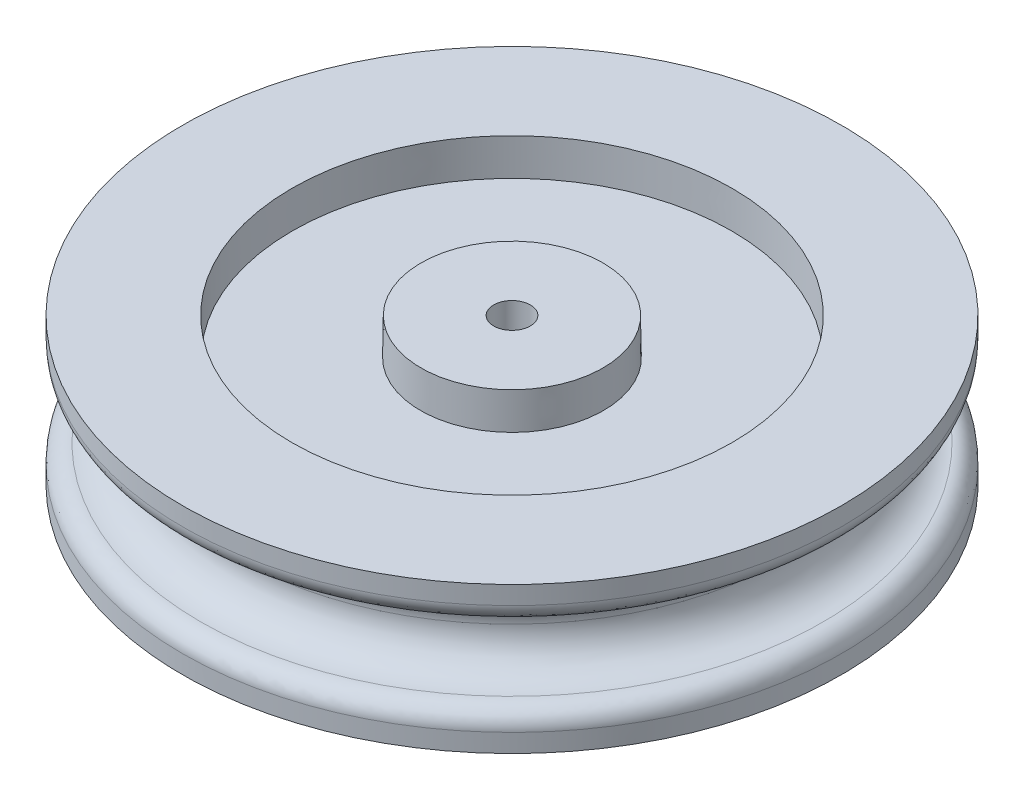
ISO-10303-21;
HEADER;
FILE_DESCRIPTION(('STEP AP214'),'2;1');
FILE_NAME('part.step','',(''),(''),'','','');
FILE_SCHEMA(('AUTOMOTIVE_DESIGN { 1 0 10303 214 1 1 1 1 }'));
ENDSEC;
DATA;
#1=APPLICATION_CONTEXT('core data for automotive mechanical design processes');
#2=APPLICATION_PROTOCOL_DEFINITION('international standard','automotive_design',2000,#1);
#3=PRODUCT_CONTEXT('',#1,'mechanical');
#4=PRODUCT('Part','Part','',(#3));
#5=PRODUCT_RELATED_PRODUCT_CATEGORY('part','',(#4));
#6=PRODUCT_DEFINITION_FORMATION('','',#4);
#7=PRODUCT_DEFINITION_CONTEXT('part definition',#1,'design');
#8=PRODUCT_DEFINITION('design','',#6,#7);
#9=PRODUCT_DEFINITION_SHAPE('','',#8);
#10=(LENGTH_UNIT() NAMED_UNIT(*) SI_UNIT(.MILLI.,.METRE.));
#11=(NAMED_UNIT(*) PLANE_ANGLE_UNIT() SI_UNIT($,.RADIAN.));
#12=(NAMED_UNIT(*) SI_UNIT($,.STERADIAN.) SOLID_ANGLE_UNIT());
#13=UNCERTAINTY_MEASURE_WITH_UNIT(LENGTH_MEASURE(1.E-05),#10,'distance_accuracy_value','');
#14=(GEOMETRIC_REPRESENTATION_CONTEXT(3) GLOBAL_UNCERTAINTY_ASSIGNED_CONTEXT((#13)) GLOBAL_UNIT_ASSIGNED_CONTEXT((#10,
#11,#12)) REPRESENTATION_CONTEXT('',''));
#15=CARTESIAN_POINT('',(0.,0.,0.));
#16=DIRECTION('',(0.,0.,1.));
#17=DIRECTION('',(1.,0.,0.));
#18=AXIS2_PLACEMENT_3D('',#15,#16,#17);
#19=CARTESIAN_POINT('',(0.,-1.2,0.));
#20=DIRECTION('',(0.,-1.,0.));
#21=DIRECTION('',(0.,0.,-1.));
#22=AXIS2_PLACEMENT_3D('',#19,#20,#21);
#23=CONICAL_SURFACE('',#22,1.,0.785398163397448);
#24=CARTESIAN_POINT('',(0.,-1.2,0.));
#25=DIRECTION('',(0.,-1.,0.));
#26=DIRECTION('',(0.,0.,-1.));
#27=AXIS2_PLACEMENT_3D('',#24,#25,#26);
#28=CIRCLE('',#27,1.);
#29=CARTESIAN_POINT('',(0.,-1.2,-1.));
#30=VERTEX_POINT('',#29);
#31=EDGE_CURVE('E42',#30,#30,#28,.T.);
#32=ORIENTED_EDGE('',*,*,#31,.F.);
#33=EDGE_LOOP('',(#32));
#34=FACE_BOUND('',#33,.T.);
#35=CARTESIAN_POINT('',(0.,-1.49999999999995,0.));
#36=DIRECTION('',(0.,-1.,0.));
#37=DIRECTION('',(0.,0.,-1.));
#38=AXIS2_PLACEMENT_3D('',#35,#36,#37);
#39=CIRCLE('',#38,1.29999999999995);
#40=CARTESIAN_POINT('',(0.,-1.49999999999995,-1.29999999999995));
#41=VERTEX_POINT('',#40);
#42=EDGE_CURVE('E18',#41,#41,#39,.F.);
#43=ORIENTED_EDGE('',*,*,#42,.F.);
#44=EDGE_LOOP('',(#43));
#45=FACE_BOUND('',#44,.T.);
#46=ADVANCED_FACE('F15',(#34,#45),#23,.F.);
#47=CARTESIAN_POINT('',(0.,2.7,0.));
#48=DIRECTION('',(0.,-1.,0.));
#49=DIRECTION('',(0.,0.,-1.));
#50=AXIS2_PLACEMENT_3D('',#47,#48,#49);
#51=CYLINDRICAL_SURFACE('',#50,1.);
#52=CARTESIAN_POINT('',(0.,2.7,0.));
#53=DIRECTION('',(0.,-1.,0.));
#54=DIRECTION('',(0.,0.,-1.));
#55=AXIS2_PLACEMENT_3D('',#52,#53,#54);
#56=CIRCLE('',#55,1.);
#57=CARTESIAN_POINT('',(0.,2.7,-1.));
#58=VERTEX_POINT('',#57);
#59=EDGE_CURVE('E77',#58,#58,#56,.T.);
#60=ORIENTED_EDGE('',*,*,#59,.F.);
#61=EDGE_LOOP('',(#60));
#62=FACE_BOUND('',#61,.T.);
#63=ORIENTED_EDGE('',*,*,#31,.T.);
#64=EDGE_LOOP('',(#63));
#65=FACE_BOUND('',#64,.T.);
#66=ADVANCED_FACE('F88',(#62,#65),#51,.F.);
#67=CARTESIAN_POINT('',(0.,-1.5,0.));
#68=DIRECTION('',(0.,-1.,0.));
#69=DIRECTION('',(0.,0.,-1.));
#70=AXIS2_PLACEMENT_3D('',#67,#68,#69);
#71=PLANE('',#70);
#72=ORIENTED_EDGE('',*,*,#42,.T.);
#73=EDGE_LOOP('',(#72));
#74=FACE_BOUND('',#73,.T.);
#75=CARTESIAN_POINT('',(0.,-1.49999999999995,0.));
#76=DIRECTION('',(0.,1.,0.));
#77=DIRECTION('',(0.,0.,1.));
#78=AXIS2_PLACEMENT_3D('',#75,#76,#77);
#79=CIRCLE('',#78,2.465091146);
#80=CARTESIAN_POINT('',(0.,-1.49999999999995,2.465091146));
#81=VERTEX_POINT('',#80);
#82=EDGE_CURVE('E75',#81,#81,#79,.T.);
#83=ORIENTED_EDGE('',*,*,#82,.F.);
#84=EDGE_LOOP('',(#83));
#85=FACE_BOUND('',#84,.T.);
#86=ADVANCED_FACE('F84',(#74,#85),#71,.T.);
#87=CARTESIAN_POINT('',(0.,2.7,0.));
#88=DIRECTION('',(0.,1.,0.));
#89=DIRECTION('',(0.,0.,1.));
#90=AXIS2_PLACEMENT_3D('',#87,#88,#89);
#91=PLANE('',#90);
#92=CARTESIAN_POINT('',(0.,2.7,0.));
#93=DIRECTION('',(0.,1.,0.));
#94=DIRECTION('',(0.,0.,1.));
#95=AXIS2_PLACEMENT_3D('',#92,#93,#94);
#96=CIRCLE('',#95,0.5);
#97=CARTESIAN_POINT('',(0.,2.7,0.5));
#98=VERTEX_POINT('',#97);
#99=EDGE_CURVE('E72',#98,#98,#96,.F.);
#100=ORIENTED_EDGE('',*,*,#99,.F.);
#101=EDGE_LOOP('',(#100));
#102=FACE_BOUND('',#101,.T.);
#103=ORIENTED_EDGE('',*,*,#59,.T.);
#104=EDGE_LOOP('',(#103));
#105=FACE_BOUND('',#104,.T.);
#106=ADVANCED_FACE('F184',(#102,#105),#91,.F.);
#107=CARTESIAN_POINT('',(0.,1.,0.));
#108=DIRECTION('',(0.,1.,0.));
#109=DIRECTION('',(0.,0.,1.));
#110=AXIS2_PLACEMENT_3D('',#107,#108,#109);
#111=CONICAL_SURFACE('',#110,2.5,0.0139626341667435);
#112=CARTESIAN_POINT('',(0.,1.,0.));
#113=DIRECTION('',(0.,1.,0.));
#114=DIRECTION('',(0.,0.,1.));
#115=AXIS2_PLACEMENT_3D('',#112,#113,#114);
#116=CIRCLE('',#115,2.5);
#117=CARTESIAN_POINT('',(0.,1.,2.5));
#118=VERTEX_POINT('',#117);
#119=EDGE_CURVE('E69',#118,#118,#116,.T.);
#120=ORIENTED_EDGE('',*,*,#119,.F.);
#121=EDGE_LOOP('',(#120));
#122=FACE_BOUND('',#121,.T.);
#123=ORIENTED_EDGE('',*,*,#82,.T.);
#124=EDGE_LOOP('',(#123));
#125=FACE_BOUND('',#124,.T.);
#126=ADVANCED_FACE('F180',(#122,#125),#111,.T.);
#127=CARTESIAN_POINT('',(0.,2.7,0.));
#128=DIRECTION('',(0.,1.,0.));
#129=DIRECTION('',(0.,0.,1.));
#130=AXIS2_PLACEMENT_3D('',#127,#128,#129);
#131=CYLINDRICAL_SURFACE('',#130,0.5);
#132=CARTESIAN_POINT('',(0.,4.,0.));
#133=DIRECTION('',(0.,1.,0.));
#134=DIRECTION('',(0.,0.,1.));
#135=AXIS2_PLACEMENT_3D('',#132,#133,#134);
#136=CIRCLE('',#135,0.5);
#137=CARTESIAN_POINT('',(0.,4.,0.5));
#138=VERTEX_POINT('',#137);
#139=EDGE_CURVE('E66',#138,#138,#136,.F.);
#140=ORIENTED_EDGE('',*,*,#139,.F.);
#141=EDGE_LOOP('',(#140));
#142=FACE_BOUND('',#141,.T.);
#143=ORIENTED_EDGE('',*,*,#99,.T.);
#144=EDGE_LOOP('',(#143));
#145=FACE_BOUND('',#144,.T.);
#146=ADVANCED_FACE('F176',(#142,#145),#131,.F.);
#147=CARTESIAN_POINT('',(0.,1.,-2.5));
#148=DIRECTION('',(0.,-1.,0.));
#149=DIRECTION('',(0.,0.,-1.));
#150=AXIS2_PLACEMENT_3D('',#147,#148,#149);
#151=PLANE('',#150);
#152=ORIENTED_EDGE('',*,*,#119,.T.);
#153=EDGE_LOOP('',(#152));
#154=FACE_BOUND('',#153,.T.);
#155=CARTESIAN_POINT('',(0.,0.99999999999989,0.));
#156=DIRECTION('',(0.,-1.,0.));
#157=DIRECTION('',(0.,0.,-1.));
#158=AXIS2_PLACEMENT_3D('',#155,#156,#157);
#159=CIRCLE('',#158,6.);
#160=CARTESIAN_POINT('',(0.,0.99999999999989,-6.));
#161=VERTEX_POINT('',#160);
#162=EDGE_CURVE('E63',#161,#161,#159,.F.);
#163=ORIENTED_EDGE('',*,*,#162,.F.);
#164=EDGE_LOOP('',(#163));
#165=FACE_BOUND('',#164,.T.);
#166=ADVANCED_FACE('F172',(#154,#165),#151,.T.);
#167=CARTESIAN_POINT('',(0.,4.,-2.5));
#168=DIRECTION('',(0.,1.,0.));
#169=DIRECTION('',(0.,0.,1.));
#170=AXIS2_PLACEMENT_3D('',#167,#168,#169);
#171=PLANE('',#170);
#172=ORIENTED_EDGE('',*,*,#139,.T.);
#173=EDGE_LOOP('',(#172));
#174=FACE_BOUND('',#173,.T.);
#175=CARTESIAN_POINT('',(0.,4.,0.));
#176=DIRECTION('',(0.,-1.,0.));
#177=DIRECTION('',(0.,0.,-1.));
#178=AXIS2_PLACEMENT_3D('',#175,#176,#177);
#179=CIRCLE('',#178,2.486036459);
#180=CARTESIAN_POINT('',(0.,4.,-2.486036459));
#181=VERTEX_POINT('',#180);
#182=EDGE_CURVE('E60',#181,#181,#179,.T.);
#183=ORIENTED_EDGE('',*,*,#182,.F.);
#184=EDGE_LOOP('',(#183));
#185=FACE_BOUND('',#184,.T.);
#186=ADVANCED_FACE('F168',(#174,#185),#171,.T.);
#187=CARTESIAN_POINT('',(0.,1.,0.));
#188=DIRECTION('',(0.,-1.,0.));
#189=DIRECTION('',(0.,0.,-1.));
#190=AXIS2_PLACEMENT_3D('',#187,#188,#189);
#191=CONICAL_SURFACE('',#190,6.,0.0139626335668602);
#192=CARTESIAN_POINT('',(0.,0.,0.));
#193=DIRECTION('',(0.,-1.,0.));
#194=DIRECTION('',(0.,0.,-1.));
#195=AXIS2_PLACEMENT_3D('',#192,#193,#194);
#196=CIRCLE('',#195,6.013963541);
#197=CARTESIAN_POINT('',(0.,0.,-6.013963541));
#198=VERTEX_POINT('',#197);
#199=EDGE_CURVE('E57',#198,#198,#196,.F.);
#200=ORIENTED_EDGE('',*,*,#199,.F.);
#201=EDGE_LOOP('',(#200));
#202=FACE_BOUND('',#201,.T.);
#203=ORIENTED_EDGE('',*,*,#162,.T.);
#204=EDGE_LOOP('',(#203));
#205=FACE_BOUND('',#204,.T.);
#206=ADVANCED_FACE('F164',(#202,#205),#191,.F.);
#207=CARTESIAN_POINT('',(0.,3.,0.));
#208=DIRECTION('',(0.,-1.,0.));
#209=DIRECTION('',(0.,0.,-1.));
#210=AXIS2_PLACEMENT_3D('',#207,#208,#209);
#211=CONICAL_SURFACE('',#210,2.5,0.0139626335668606);
#212=ORIENTED_EDGE('',*,*,#182,.T.);
#213=EDGE_LOOP('',(#212));
#214=FACE_BOUND('',#213,.T.);
#215=CARTESIAN_POINT('',(0.,2.99999999999989,0.));
#216=DIRECTION('',(0.,-1.,0.));
#217=DIRECTION('',(0.,0.,-1.));
#218=AXIS2_PLACEMENT_3D('',#215,#216,#217);
#219=CIRCLE('',#218,2.5);
#220=CARTESIAN_POINT('',(0.,2.99999999999989,-2.5));
#221=VERTEX_POINT('',#220);
#222=EDGE_CURVE('E54',#221,#221,#219,.T.);
#223=ORIENTED_EDGE('',*,*,#222,.F.);
#224=EDGE_LOOP('',(#223));
#225=FACE_BOUND('',#224,.T.);
#226=ADVANCED_FACE('F160',(#214,#225),#211,.T.);
#227=CARTESIAN_POINT('',(0.,0.,-6.));
#228=DIRECTION('',(0.,-1.,0.));
#229=DIRECTION('',(0.,0.,-1.));
#230=AXIS2_PLACEMENT_3D('',#227,#228,#229);
#231=PLANE('',#230);
#232=ORIENTED_EDGE('',*,*,#199,.T.);
#233=EDGE_LOOP('',(#232));
#234=FACE_BOUND('',#233,.T.);
#235=CARTESIAN_POINT('',(0.,0.,0.));
#236=DIRECTION('',(0.,-1.,0.));
#237=DIRECTION('',(0.,0.,-1.));
#238=AXIS2_PLACEMENT_3D('',#235,#236,#237);
#239=CIRCLE('',#238,9.);
#240=CARTESIAN_POINT('',(0.,0.,-9.));
#241=VERTEX_POINT('',#240);
#242=EDGE_CURVE('E51',#241,#241,#239,.F.);
#243=ORIENTED_EDGE('',*,*,#242,.F.);
#244=EDGE_LOOP('',(#243));
#245=FACE_BOUND('',#244,.T.);
#246=ADVANCED_FACE('F156',(#234,#245),#231,.T.);
#247=CARTESIAN_POINT('',(0.,3.,-6.));
#248=DIRECTION('',(0.,1.,0.));
#249=DIRECTION('',(0.,0.,1.));
#250=AXIS2_PLACEMENT_3D('',#247,#248,#249);
#251=PLANE('',#250);
#252=ORIENTED_EDGE('',*,*,#222,.T.);
#253=EDGE_LOOP('',(#252));
#254=FACE_BOUND('',#253,.T.);
#255=CARTESIAN_POINT('',(0.,3.,0.));
#256=DIRECTION('',(0.,1.,0.));
#257=DIRECTION('',(0.,0.,1.));
#258=AXIS2_PLACEMENT_3D('',#255,#256,#257);
#259=CIRCLE('',#258,6.);
#260=CARTESIAN_POINT('',(0.,3.,6.));
#261=VERTEX_POINT('',#260);
#262=EDGE_CURVE('E38',#261,#261,#259,.F.);
#263=ORIENTED_EDGE('',*,*,#262,.F.);
#264=EDGE_LOOP('',(#263));
#265=FACE_BOUND('',#264,.T.);
#266=ADVANCED_FACE('F152',(#254,#265),#251,.T.);
#267=CARTESIAN_POINT('',(0.,0.,0.));
#268=DIRECTION('',(0.,-1.,0.));
#269=DIRECTION('',(0.,0.,-1.));
#270=AXIS2_PLACEMENT_3D('',#267,#268,#269);
#271=CYLINDRICAL_SURFACE('',#270,9.);
#272=CARTESIAN_POINT('',(0.,0.500000000000002,0.));
#273=DIRECTION('',(0.,1.,0.));
#274=DIRECTION('',(0.,0.,1.));
#275=AXIS2_PLACEMENT_3D('',#272,#273,#274);
#276=CIRCLE('',#275,9.);
#277=CARTESIAN_POINT('',(0.,0.500000000000002,9.));
#278=VERTEX_POINT('',#277);
#279=EDGE_CURVE('E34',#278,#278,#276,.T.);
#280=ORIENTED_EDGE('',*,*,#279,.F.);
#281=EDGE_LOOP('',(#280));
#282=FACE_BOUND('',#281,.T.);
#283=ORIENTED_EDGE('',*,*,#242,.T.);
#284=EDGE_LOOP('',(#283));
#285=FACE_BOUND('',#284,.T.);
#286=ADVANCED_FACE('F148',(#282,#285),#271,.T.);
#287=CARTESIAN_POINT('',(0.,3.,0.));
#288=DIRECTION('',(0.,1.,0.));
#289=DIRECTION('',(0.,0.,1.));
#290=AXIS2_PLACEMENT_3D('',#287,#288,#289);
#291=CONICAL_SURFACE('',#290,6.,0.0139626335668602);
#292=ORIENTED_EDGE('',*,*,#262,.T.);
#293=EDGE_LOOP('',(#292));
#294=FACE_BOUND('',#293,.T.);
#295=CARTESIAN_POINT('',(0.,3.99999999999989,0.));
#296=DIRECTION('',(0.,1.,0.));
#297=DIRECTION('',(0.,0.,1.));
#298=AXIS2_PLACEMENT_3D('',#295,#296,#297);
#299=CIRCLE('',#298,6.013963541);
#300=CARTESIAN_POINT('',(0.,3.99999999999989,6.013963541));
#301=VERTEX_POINT('',#300);
#302=EDGE_CURVE('E37',#301,#301,#299,.F.);
#303=ORIENTED_EDGE('',*,*,#302,.F.);
#304=EDGE_LOOP('',(#303));
#305=FACE_BOUND('',#304,.T.);
#306=ADVANCED_FACE('F144',(#294,#305),#291,.F.);
#307=CARTESIAN_POINT('',(0.,1.,8.5));
#308=CARTESIAN_POINT('',(0.,1.,8.79289321881345));
#309=CARTESIAN_POINT('',(0.,0.792893218813454,9.));
#310=CARTESIAN_POINT('',(0.,0.500000000000002,9.));
#311=(BOUNDED_CURVE() B_SPLINE_CURVE(3,(#307,#308,#309,#310),.UNSPECIFIED.,.F.,
.F.) B_SPLINE_CURVE_WITH_KNOTS((4,4),(0.,1.),
.UNSPECIFIED.) CURVE() GEOMETRIC_REPRESENTATION_ITEM() RATIONAL_B_SPLINE_CURVE((1.,
0.804737854124365,0.804737854124365,1.)) REPRESENTATION_ITEM(''));
#312=CARTESIAN_POINT('',(0.,0.5,0.));
#313=DIRECTION('',(0.,1.,0.));
#314=AXIS1_PLACEMENT('',#312,#313);
#315=SURFACE_OF_REVOLUTION('',#311,#314);
#316=ORIENTED_EDGE('',*,*,#279,.T.);
#317=EDGE_LOOP('',(#316));
#318=FACE_BOUND('',#317,.T.);
#319=CARTESIAN_POINT('',(0.,0.999999999999999,0.));
#320=DIRECTION('',(0.,1.,0.));
#321=DIRECTION('',(0.,0.,1.));
#322=AXIS2_PLACEMENT_3D('',#319,#320,#321);
#323=CIRCLE('',#322,8.5);
#324=CARTESIAN_POINT('',(0.,0.999999999999999,8.5));
#325=VERTEX_POINT('',#324);
#326=EDGE_CURVE('E39',#325,#325,#323,.T.);
#327=ORIENTED_EDGE('',*,*,#326,.F.);
#328=EDGE_LOOP('',(#327));
#329=FACE_BOUND('',#328,.T.);
#330=ADVANCED_FACE('F140',(#318,#329),#315,.F.);
#331=CARTESIAN_POINT('',(0.,4.,-9.));
#332=DIRECTION('',(0.,1.,0.));
#333=DIRECTION('',(0.,0.,1.));
#334=AXIS2_PLACEMENT_3D('',#331,#332,#333);
#335=PLANE('',#334);
#336=ORIENTED_EDGE('',*,*,#302,.T.);
#337=EDGE_LOOP('',(#336));
#338=FACE_BOUND('',#337,.T.);
#339=CARTESIAN_POINT('',(0.,4.,0.));
#340=DIRECTION('',(0.,-1.,0.));
#341=DIRECTION('',(1.,0.,0.));
#342=AXIS2_PLACEMENT_3D('',#339,#340,#341);
#343=CIRCLE('',#342,9.);
#344=CARTESIAN_POINT('',(9.,4.,0.));
#345=VERTEX_POINT('',#344);
#346=EDGE_CURVE('E33',#345,#345,#343,.T.);
#347=ORIENTED_EDGE('',*,*,#346,.F.);
#348=EDGE_LOOP('',(#347));
#349=FACE_BOUND('',#348,.T.);
#350=ADVANCED_FACE('F136',(#338,#349),#335,.T.);
#351=CARTESIAN_POINT('',(0.,1.99999999999999,7.5));
#352=CARTESIAN_POINT('',(0.,1.41421356237309,7.5));
#353=CARTESIAN_POINT('',(0.,0.999999999999995,7.9142135623731));
#354=CARTESIAN_POINT('',(0.,0.999999999999999,8.5));
#355=(BOUNDED_CURVE() B_SPLINE_CURVE(3,(#351,#352,#353,#354),.UNSPECIFIED.,.F.,
.F.) B_SPLINE_CURVE_WITH_KNOTS((4,4),(0.,1.),
.UNSPECIFIED.) CURVE() GEOMETRIC_REPRESENTATION_ITEM() RATIONAL_B_SPLINE_CURVE((1.,
0.804737854124365,0.804737854124365,1.)) REPRESENTATION_ITEM(''));
#356=CARTESIAN_POINT('',(0.,2.,0.));
#357=DIRECTION('',(0.,1.,0.));
#358=AXIS1_PLACEMENT('',#356,#357);
#359=SURFACE_OF_REVOLUTION('',#355,#358);
#360=ORIENTED_EDGE('',*,*,#326,.T.);
#361=EDGE_LOOP('',(#360));
#362=FACE_BOUND('',#361,.T.);
#363=CARTESIAN_POINT('',(0.,2.,0.));
#364=DIRECTION('',(0.,-1.,0.));
#365=DIRECTION('',(0.,0.,-1.));
#366=AXIS2_PLACEMENT_3D('',#363,#364,#365);
#367=CIRCLE('',#366,7.5);
#368=CARTESIAN_POINT('',(0.,2.,-7.5));
#369=VERTEX_POINT('',#368);
#370=EDGE_CURVE('E27',#369,#369,#367,.F.);
#371=ORIENTED_EDGE('',*,*,#370,.F.);
#372=EDGE_LOOP('',(#371));
#373=FACE_BOUND('',#372,.T.);
#374=ADVANCED_FACE('F133',(#362,#373),#359,.F.);
#375=CARTESIAN_POINT('',(0.,3.5,0.));
#376=DIRECTION('',(0.,-1.,0.));
#377=DIRECTION('',(1.,0.,0.));
#378=AXIS2_PLACEMENT_3D('',#375,#376,#377);
#379=CYLINDRICAL_SURFACE('',#378,9.);
#380=ORIENTED_EDGE('',*,*,#346,.T.);
#381=EDGE_LOOP('',(#380));
#382=FACE_BOUND('',#381,.T.);
#383=CARTESIAN_POINT('',(0.,3.5,0.));
#384=DIRECTION('',(0.,-1.,0.));
#385=DIRECTION('',(0.,0.,-1.));
#386=AXIS2_PLACEMENT_3D('',#383,#384,#385);
#387=CIRCLE('',#386,9.);
#388=CARTESIAN_POINT('',(0.,3.5,-9.));
#389=VERTEX_POINT('',#388);
#390=EDGE_CURVE('E22',#389,#389,#387,.T.);
#391=ORIENTED_EDGE('',*,*,#390,.F.);
#392=EDGE_LOOP('',(#391));
#393=FACE_BOUND('',#392,.T.);
#394=ADVANCED_FACE('F104',(#382,#393),#379,.T.);
#395=CARTESIAN_POINT('',(0.,2.,-7.5));
#396=CARTESIAN_POINT('',(0.,2.5857864376269,-7.5));
#397=CARTESIAN_POINT('',(0.,3.,-7.9142135623731));
#398=CARTESIAN_POINT('',(0.,3.,-8.5));
#399=(BOUNDED_CURVE() B_SPLINE_CURVE(3,(#395,#396,#397,#398),.UNSPECIFIED.,.F.,
.F.) B_SPLINE_CURVE_WITH_KNOTS((4,4),(0.,1.),
.UNSPECIFIED.) CURVE() GEOMETRIC_REPRESENTATION_ITEM() RATIONAL_B_SPLINE_CURVE((1.,
0.804737854124365,0.804737854124365,1.)) REPRESENTATION_ITEM(''));
#400=CARTESIAN_POINT('',(0.,2.,0.));
#401=DIRECTION('',(0.,-1.,0.));
#402=AXIS1_PLACEMENT('',#400,#401);
#403=SURFACE_OF_REVOLUTION('',#399,#402);
#404=CARTESIAN_POINT('',(0.,3.,0.));
#405=DIRECTION('',(0.,-1.,0.));
#406=DIRECTION('',(0.,0.,-1.));
#407=AXIS2_PLACEMENT_3D('',#404,#405,#406);
#408=CIRCLE('',#407,8.50000000000001);
#409=CARTESIAN_POINT('',(0.,3.,-8.50000000000001));
#410=VERTEX_POINT('',#409);
#411=EDGE_CURVE('E10',#410,#410,#408,.F.);
#412=ORIENTED_EDGE('',*,*,#411,.F.);
#413=EDGE_LOOP('',(#412));
#414=FACE_BOUND('',#413,.T.);
#415=ORIENTED_EDGE('',*,*,#370,.T.);
#416=EDGE_LOOP('',(#415));
#417=FACE_BOUND('',#416,.T.);
#418=ADVANCED_FACE('F98',(#414,#417),#403,.F.);
#419=CARTESIAN_POINT('',(0.,3.,-8.50000000000001));
#420=CARTESIAN_POINT('',(0.,3.,-8.79289321881346));
#421=CARTESIAN_POINT('',(0.,3.20710678118655,-9.));
#422=CARTESIAN_POINT('',(0.,3.5,-9.));
#423=(BOUNDED_CURVE() B_SPLINE_CURVE(3,(#419,#420,#421,#422),.UNSPECIFIED.,.F.,
.F.) B_SPLINE_CURVE_WITH_KNOTS((4,4),(0.,1.),
.UNSPECIFIED.) CURVE() GEOMETRIC_REPRESENTATION_ITEM() RATIONAL_B_SPLINE_CURVE((1.,
0.804737854124367,0.804737854124367,1.)) REPRESENTATION_ITEM(''));
#424=CARTESIAN_POINT('',(0.,3.5,0.));
#425=DIRECTION('',(0.,-1.,0.));
#426=AXIS1_PLACEMENT('',#424,#425);
#427=SURFACE_OF_REVOLUTION('',#423,#426);
#428=ORIENTED_EDGE('',*,*,#390,.T.);
#429=EDGE_LOOP('',(#428));
#430=FACE_BOUND('',#429,.T.);
#431=ORIENTED_EDGE('',*,*,#411,.T.);
#432=EDGE_LOOP('',(#431));
#433=FACE_BOUND('',#432,.T.);
#434=ADVANCED_FACE('F96',(#430,#433),#427,.F.);
#435=CLOSED_SHELL('',(#46,#66,#86,#106,#126,#146,#166,#186,#206,#226,#246,#266,#286,#306,#330,
#350,#374,#394,#418,#434));
#436=MANIFOLD_SOLID_BREP('B1',#435);
#437=ADVANCED_BREP_SHAPE_REPRESENTATION('',(#18,#436),#14);
#438=SHAPE_DEFINITION_REPRESENTATION(#9,#437);
ENDSEC;
END-ISO-10303-21;
